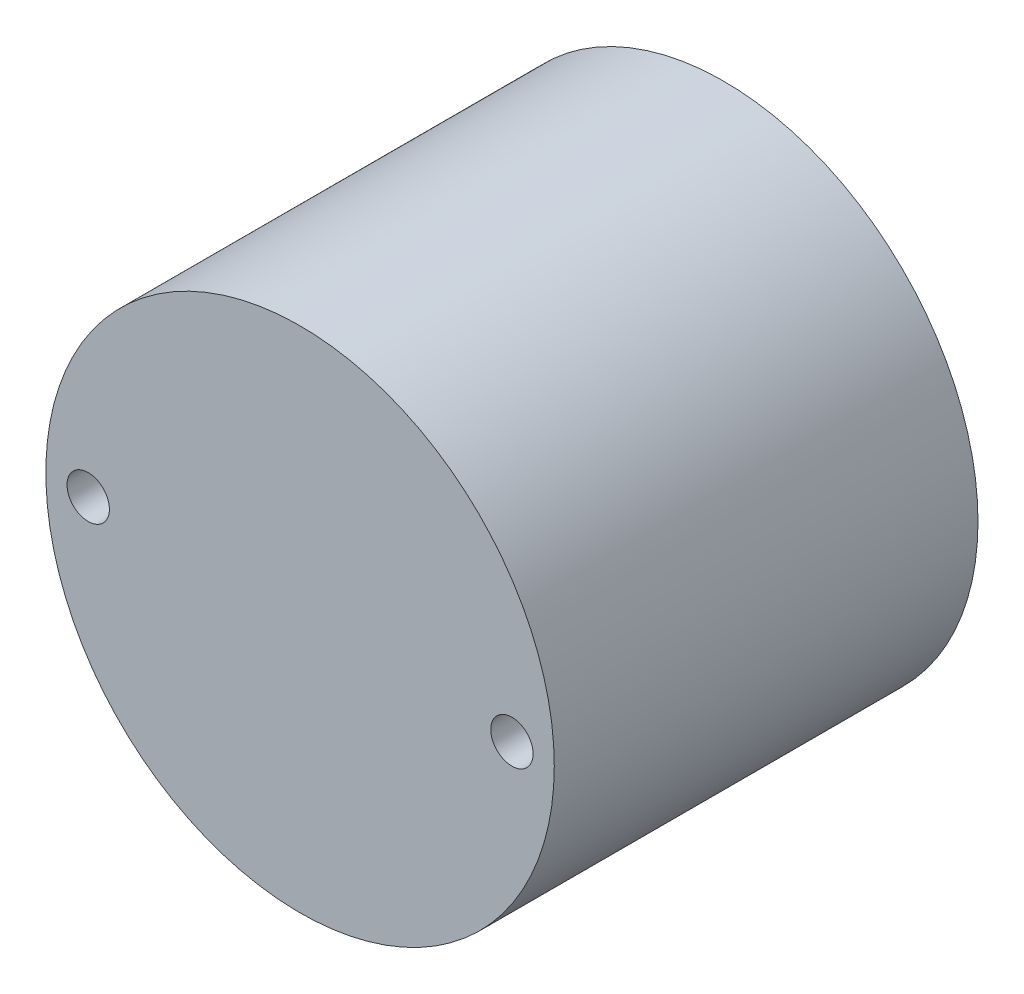
ISO-10303-21;
HEADER;
FILE_DESCRIPTION(('STEP AP214'),'2;1');
FILE_NAME('part.step','',(''),(''),'','','');
FILE_SCHEMA(('AUTOMOTIVE_DESIGN { 1 0 10303 214 1 1 1 1 }'));
ENDSEC;
DATA;
#1=APPLICATION_CONTEXT('core data for automotive mechanical design processes');
#2=APPLICATION_PROTOCOL_DEFINITION('international standard','automotive_design',2000,#1);
#3=PRODUCT_CONTEXT('',#1,'mechanical');
#4=PRODUCT('Part','Part','',(#3));
#5=PRODUCT_RELATED_PRODUCT_CATEGORY('part','',(#4));
#6=PRODUCT_DEFINITION_FORMATION('','',#4);
#7=PRODUCT_DEFINITION_CONTEXT('part definition',#1,'design');
#8=PRODUCT_DEFINITION('design','',#6,#7);
#9=PRODUCT_DEFINITION_SHAPE('','',#8);
#10=(LENGTH_UNIT() NAMED_UNIT(*) SI_UNIT(.MILLI.,.METRE.));
#11=(NAMED_UNIT(*) PLANE_ANGLE_UNIT() SI_UNIT($,.RADIAN.));
#12=(NAMED_UNIT(*) SI_UNIT($,.STERADIAN.) SOLID_ANGLE_UNIT());
#13=UNCERTAINTY_MEASURE_WITH_UNIT(LENGTH_MEASURE(1.E-05),#10,'distance_accuracy_value','');
#14=(GEOMETRIC_REPRESENTATION_CONTEXT(3) GLOBAL_UNCERTAINTY_ASSIGNED_CONTEXT((#13)) GLOBAL_UNIT_ASSIGNED_CONTEXT((#10,
#11,#12)) REPRESENTATION_CONTEXT('',''));
#15=CARTESIAN_POINT('',(0.,0.,0.));
#16=DIRECTION('',(0.,0.,1.));
#17=DIRECTION('',(1.,0.,0.));
#18=AXIS2_PLACEMENT_3D('',#15,#16,#17);
#19=CARTESIAN_POINT('',(0.,0.,10.));
#20=DIRECTION('',(0.,0.,1.));
#21=DIRECTION('',(1.,0.,0.));
#22=AXIS2_PLACEMENT_3D('',#19,#20,#21);
#23=PLANE('',#22);
#24=CARTESIAN_POINT('',(-5.,0.,10.));
#25=DIRECTION('',(0.,0.,1.));
#26=DIRECTION('',(1.,0.,0.));
#27=AXIS2_PLACEMENT_3D('',#24,#25,#26);
#28=CIRCLE('',#27,0.500000000000001);
#29=CARTESIAN_POINT('',(-4.5,0.,10.));
#30=VERTEX_POINT('',#29);
#31=EDGE_CURVE('E50',#30,#30,#28,.T.);
#32=ORIENTED_EDGE('',*,*,#31,.F.);
#33=EDGE_LOOP('',(#32));
#34=FACE_BOUND('',#33,.T.);
#35=CARTESIAN_POINT('',(0.,0.,10.));
#36=DIRECTION('',(0.,0.,1.));
#37=DIRECTION('',(1.,0.,0.));
#38=AXIS2_PLACEMENT_3D('',#35,#36,#37);
#39=CIRCLE('',#38,6.);
#40=CARTESIAN_POINT('',(6.,0.,10.));
#41=VERTEX_POINT('',#40);
#42=EDGE_CURVE('E10',#41,#41,#39,.T.);
#43=ORIENTED_EDGE('',*,*,#42,.T.);
#44=EDGE_LOOP('',(#43));
#45=FACE_BOUND('',#44,.T.);
#46=CARTESIAN_POINT('',(5.,0.,10.));
#47=DIRECTION('',(0.,0.,1.));
#48=DIRECTION('',(1.,0.,0.));
#49=AXIS2_PLACEMENT_3D('',#46,#47,#48);
#50=CIRCLE('',#49,0.500000000000001);
#51=CARTESIAN_POINT('',(5.5,0.,10.));
#52=VERTEX_POINT('',#51);
#53=EDGE_CURVE('E56',#52,#52,#50,.T.);
#54=ORIENTED_EDGE('',*,*,#53,.F.);
#55=EDGE_LOOP('',(#54));
#56=FACE_BOUND('',#55,.T.);
#57=ADVANCED_FACE('F37',(#34,#45,#56),#23,.T.);
#58=CARTESIAN_POINT('',(0.,0.,0.));
#59=DIRECTION('',(0.,0.,1.));
#60=DIRECTION('',(1.,0.,0.));
#61=AXIS2_PLACEMENT_3D('',#58,#59,#60);
#62=PLANE('',#61);
#63=CARTESIAN_POINT('',(0.,0.,0.));
#64=DIRECTION('',(0.,0.,1.));
#65=DIRECTION('',(1.,0.,0.));
#66=AXIS2_PLACEMENT_3D('',#63,#64,#65);
#67=CIRCLE('',#66,6.);
#68=CARTESIAN_POINT('',(6.,0.,0.));
#69=VERTEX_POINT('',#68);
#70=EDGE_CURVE('E41',#69,#69,#67,.T.);
#71=ORIENTED_EDGE('',*,*,#70,.F.);
#72=EDGE_LOOP('',(#71));
#73=FACE_BOUND('',#72,.T.);
#74=CARTESIAN_POINT('',(-5.,0.,0.));
#75=DIRECTION('',(0.,0.,1.));
#76=DIRECTION('',(1.,0.,0.));
#77=AXIS2_PLACEMENT_3D('',#74,#75,#76);
#78=CIRCLE('',#77,0.500000000000001);
#79=CARTESIAN_POINT('',(-4.5,0.,0.));
#80=VERTEX_POINT('',#79);
#81=EDGE_CURVE('E52',#80,#80,#78,.T.);
#82=ORIENTED_EDGE('',*,*,#81,.T.);
#83=EDGE_LOOP('',(#82));
#84=FACE_BOUND('',#83,.T.);
#85=CARTESIAN_POINT('',(5.,0.,0.));
#86=DIRECTION('',(0.,0.,1.));
#87=DIRECTION('',(1.,0.,0.));
#88=AXIS2_PLACEMENT_3D('',#85,#86,#87);
#89=CIRCLE('',#88,0.500000000000001);
#90=CARTESIAN_POINT('',(5.5,0.,0.));
#91=VERTEX_POINT('',#90);
#92=EDGE_CURVE('E60',#91,#91,#89,.T.);
#93=ORIENTED_EDGE('',*,*,#92,.T.);
#94=EDGE_LOOP('',(#93));
#95=FACE_BOUND('',#94,.T.);
#96=ADVANCED_FACE('F72',(#73,#84,#95),#62,.F.);
#97=CARTESIAN_POINT('',(0.,0.,10.));
#98=DIRECTION('',(0.,0.,-1.));
#99=DIRECTION('',(-1.,0.,0.));
#100=AXIS2_PLACEMENT_3D('',#97,#98,#99);
#101=CYLINDRICAL_SURFACE('',#100,6.);
#102=ORIENTED_EDGE('',*,*,#42,.F.);
#103=EDGE_LOOP('',(#102));
#104=FACE_BOUND('',#103,.T.);
#105=ORIENTED_EDGE('',*,*,#70,.T.);
#106=EDGE_LOOP('',(#105));
#107=FACE_BOUND('',#106,.T.);
#108=ADVANCED_FACE('F39',(#104,#107),#101,.T.);
#109=CARTESIAN_POINT('',(-5.,0.,10.));
#110=DIRECTION('',(0.,0.,-1.));
#111=DIRECTION('',(-1.,0.,0.));
#112=AXIS2_PLACEMENT_3D('',#109,#110,#111);
#113=CYLINDRICAL_SURFACE('',#112,0.500000000000001);
#114=ORIENTED_EDGE('',*,*,#31,.T.);
#115=EDGE_LOOP('',(#114));
#116=FACE_BOUND('',#115,.T.);
#117=ORIENTED_EDGE('',*,*,#81,.F.);
#118=EDGE_LOOP('',(#117));
#119=FACE_BOUND('',#118,.T.);
#120=ADVANCED_FACE('F81',(#116,#119),#113,.F.);
#121=CARTESIAN_POINT('',(5.,0.,10.));
#122=DIRECTION('',(0.,0.,-1.));
#123=DIRECTION('',(-1.,0.,0.));
#124=AXIS2_PLACEMENT_3D('',#121,#122,#123);
#125=CYLINDRICAL_SURFACE('',#124,0.500000000000001);
#126=ORIENTED_EDGE('',*,*,#53,.T.);
#127=EDGE_LOOP('',(#126));
#128=FACE_BOUND('',#127,.T.);
#129=ORIENTED_EDGE('',*,*,#92,.F.);
#130=EDGE_LOOP('',(#129));
#131=FACE_BOUND('',#130,.T.);
#132=ADVANCED_FACE('F68',(#128,#131),#125,.F.);
#133=CLOSED_SHELL('',(#57,#96,#108,#120,#132));
#134=MANIFOLD_SOLID_BREP('B2',#133);
#135=ADVANCED_BREP_SHAPE_REPRESENTATION('',(#18,#134),#14);
#136=SHAPE_DEFINITION_REPRESENTATION(#9,#135);
ENDSEC;
END-ISO-10303-21;
